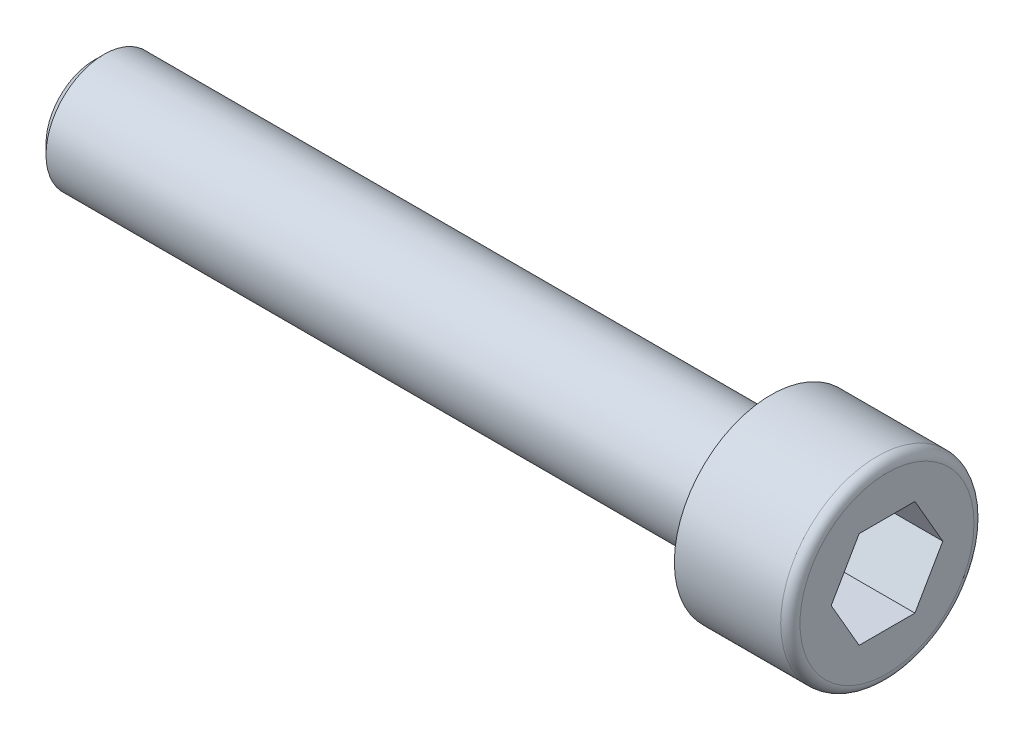
ISO-10303-21;
HEADER;
FILE_DESCRIPTION(('STEP AP214'),'2;1');
FILE_NAME('part.step','',(''),(''),'','','');
FILE_SCHEMA(('AUTOMOTIVE_DESIGN { 1 0 10303 214 1 1 1 1 }'));
ENDSEC;
DATA;
#1=APPLICATION_CONTEXT('core data for automotive mechanical design processes');
#2=APPLICATION_PROTOCOL_DEFINITION('international standard','automotive_design',2000,#1);
#3=PRODUCT_CONTEXT('',#1,'mechanical');
#4=PRODUCT('Part','Part','',(#3));
#5=PRODUCT_RELATED_PRODUCT_CATEGORY('part','',(#4));
#6=PRODUCT_DEFINITION_FORMATION('','',#4);
#7=PRODUCT_DEFINITION_CONTEXT('part definition',#1,'design');
#8=PRODUCT_DEFINITION('design','',#6,#7);
#9=PRODUCT_DEFINITION_SHAPE('','',#8);
#10=(LENGTH_UNIT() NAMED_UNIT(*) SI_UNIT(.MILLI.,.METRE.));
#11=(NAMED_UNIT(*) PLANE_ANGLE_UNIT() SI_UNIT($,.RADIAN.));
#12=(NAMED_UNIT(*) SI_UNIT($,.STERADIAN.) SOLID_ANGLE_UNIT());
#13=UNCERTAINTY_MEASURE_WITH_UNIT(LENGTH_MEASURE(1.E-05),#10,'distance_accuracy_value','');
#14=(GEOMETRIC_REPRESENTATION_CONTEXT(3) GLOBAL_UNCERTAINTY_ASSIGNED_CONTEXT((#13)) GLOBAL_UNIT_ASSIGNED_CONTEXT((#10,
#11,#12)) REPRESENTATION_CONTEXT('',''));
#15=CARTESIAN_POINT('',(0.,0.,0.));
#16=DIRECTION('',(0.,0.,1.));
#17=DIRECTION('',(1.,0.,0.));
#18=AXIS2_PLACEMENT_3D('',#15,#16,#17);
#19=CARTESIAN_POINT('',(0.,0.,0.));
#20=DIRECTION('',(-1.,0.,0.));
#21=DIRECTION('',(0.,0.,-1.));
#22=AXIS2_PLACEMENT_3D('',#19,#20,#21);
#23=PLANE('',#22);
#24=DIRECTION('',(0.,0.866025403784438,-0.5));
#25=VECTOR('',#24,1.);
#26=CARTESIAN_POINT('',(0.,0.,2.88675134594813));
#27=LINE('',#26,#25);
#28=CARTESIAN_POINT('',(0.,0.,2.88675134594813));
#29=VERTEX_POINT('',#28);
#30=CARTESIAN_POINT('',(0.,2.5,1.44337567297406));
#31=VERTEX_POINT('',#30);
#32=EDGE_CURVE('E106',#29,#31,#27,.T.);
#33=ORIENTED_EDGE('',*,*,#32,.T.);
#34=DIRECTION('',(0.,0.,-1.));
#35=VECTOR('',#34,1.);
#36=CARTESIAN_POINT('',(0.,2.5,1.44337567297406));
#37=LINE('',#36,#35);
#38=CARTESIAN_POINT('',(0.,2.5,-1.44337567297406));
#39=VERTEX_POINT('',#38);
#40=EDGE_CURVE('E110',#31,#39,#37,.T.);
#41=ORIENTED_EDGE('',*,*,#40,.T.);
#42=DIRECTION('',(0.,-0.866025403784439,-0.5));
#43=VECTOR('',#42,1.);
#44=CARTESIAN_POINT('',(0.,2.5,-1.44337567297406));
#45=LINE('',#44,#43);
#46=CARTESIAN_POINT('',(0.,0.,-2.88675134594813));
#47=VERTEX_POINT('',#46);
#48=EDGE_CURVE('E115',#39,#47,#45,.T.);
#49=ORIENTED_EDGE('',*,*,#48,.T.);
#50=DIRECTION('',(0.,-0.866025403784438,0.5));
#51=VECTOR('',#50,1.);
#52=CARTESIAN_POINT('',(0.,0.,-2.88675134594813));
#53=LINE('',#52,#51);
#54=CARTESIAN_POINT('',(0.,-2.5,-1.44337567297406));
#55=VERTEX_POINT('',#54);
#56=EDGE_CURVE('E125',#47,#55,#53,.T.);
#57=ORIENTED_EDGE('',*,*,#56,.T.);
#58=DIRECTION('',(0.,0.,1.));
#59=VECTOR('',#58,1.);
#60=CARTESIAN_POINT('',(0.,-2.5,-1.44337567297406));
#61=LINE('',#60,#59);
#62=CARTESIAN_POINT('',(0.,-2.5,1.44337567297406));
#63=VERTEX_POINT('',#62);
#64=EDGE_CURVE('E128',#55,#63,#61,.T.);
#65=ORIENTED_EDGE('',*,*,#64,.T.);
#66=DIRECTION('',(0.,0.866025403784439,0.5));
#67=VECTOR('',#66,1.);
#68=CARTESIAN_POINT('',(0.,-2.5,1.44337567297406));
#69=LINE('',#68,#67);
#70=EDGE_CURVE('E119',#63,#29,#69,.T.);
#71=ORIENTED_EDGE('',*,*,#70,.T.);
#72=EDGE_LOOP('',(#33,#41,#49,#57,#65,#71));
#73=FACE_BOUND('',#72,.T.);
#74=CARTESIAN_POINT('',(0.,0.,0.));
#75=DIRECTION('',(1.,0.,0.));
#76=DIRECTION('',(0.,0.,-1.));
#77=AXIS2_PLACEMENT_3D('',#74,#75,#76);
#78=CIRCLE('',#77,4.5);
#79=CARTESIAN_POINT('',(0.,0.,-4.5));
#80=VERTEX_POINT('',#79);
#81=EDGE_CURVE('E12',#80,#80,#78,.F.);
#82=ORIENTED_EDGE('',*,*,#81,.F.);
#83=EDGE_LOOP('',(#82));
#84=FACE_BOUND('',#83,.T.);
#85=ADVANCED_FACE('F39',(#73,#84),#23,.F.);
#86=CARTESIAN_POINT('',(-123.158940217391,0.,0.));
#87=DIRECTION('',(-1.,0.,0.));
#88=DIRECTION('',(0.,0.,-1.));
#89=AXIS2_PLACEMENT_3D('',#86,#87,#88);
#90=CYLINDRICAL_SURFACE('',#89,5.);
#91=CARTESIAN_POINT('',(-0.5,0.,0.));
#92=DIRECTION('',(1.,0.,0.));
#93=DIRECTION('',(0.,0.,-1.));
#94=AXIS2_PLACEMENT_3D('',#91,#92,#93);
#95=CIRCLE('',#94,5.);
#96=CARTESIAN_POINT('',(-0.5,0.,-5.));
#97=VERTEX_POINT('',#96);
#98=EDGE_CURVE('E47',#97,#97,#95,.T.);
#99=ORIENTED_EDGE('',*,*,#98,.F.);
#100=EDGE_LOOP('',(#99));
#101=FACE_BOUND('',#100,.T.);
#102=CARTESIAN_POINT('',(-6.00000000000001,0.,0.));
#103=DIRECTION('',(1.,0.,0.));
#104=DIRECTION('',(0.,0.,-1.));
#105=AXIS2_PLACEMENT_3D('',#102,#103,#104);
#106=CIRCLE('',#105,5.);
#107=CARTESIAN_POINT('',(-6.00000000000001,0.,-5.));
#108=VERTEX_POINT('',#107);
#109=EDGE_CURVE('E143',#108,#108,#106,.T.);
#110=ORIENTED_EDGE('',*,*,#109,.T.);
#111=EDGE_LOOP('',(#110));
#112=FACE_BOUND('',#111,.T.);
#113=ADVANCED_FACE('F155',(#101,#112),#90,.T.);
#114=CARTESIAN_POINT('',(-6.,5.,0.));
#115=DIRECTION('',(1.,0.,0.));
#116=DIRECTION('',(0.,0.,1.));
#117=AXIS2_PLACEMENT_3D('',#114,#115,#116);
#118=PLANE('',#117);
#119=CARTESIAN_POINT('',(-6.00000000000001,0.,0.));
#120=DIRECTION('',(1.,0.,0.));
#121=DIRECTION('',(0.,0.,-1.));
#122=AXIS2_PLACEMENT_3D('',#119,#120,#121);
#123=CIRCLE('',#122,3.);
#124=CARTESIAN_POINT('',(-6.00000000000001,0.,-3.));
#125=VERTEX_POINT('',#124);
#126=EDGE_CURVE('E139',#125,#125,#123,.T.);
#127=ORIENTED_EDGE('',*,*,#126,.T.);
#128=EDGE_LOOP('',(#127));
#129=FACE_BOUND('',#128,.T.);
#130=ORIENTED_EDGE('',*,*,#109,.F.);
#131=EDGE_LOOP('',(#130));
#132=FACE_BOUND('',#131,.T.);
#133=ADVANCED_FACE('F158',(#129,#132),#118,.F.);
#134=CARTESIAN_POINT('',(-123.158940217391,0.,0.));
#135=DIRECTION('',(-1.,0.,0.));
#136=DIRECTION('',(0.,0.,-1.));
#137=AXIS2_PLACEMENT_3D('',#134,#135,#136);
#138=CYLINDRICAL_SURFACE('',#137,3.);
#139=CARTESIAN_POINT('',(-40.5,0.,0.));
#140=DIRECTION('',(-1.,0.,0.));
#141=DIRECTION('',(0.,0.,1.));
#142=AXIS2_PLACEMENT_3D('',#139,#140,#141);
#143=CIRCLE('',#142,3.);
#144=CARTESIAN_POINT('',(-40.5,0.,3.));
#145=VERTEX_POINT('',#144);
#146=EDGE_CURVE('E149',#145,#145,#143,.T.);
#147=ORIENTED_EDGE('',*,*,#146,.F.);
#148=EDGE_LOOP('',(#147));
#149=FACE_BOUND('',#148,.T.);
#150=ORIENTED_EDGE('',*,*,#126,.F.);
#151=EDGE_LOOP('',(#150));
#152=FACE_BOUND('',#151,.T.);
#153=ADVANCED_FACE('F163',(#149,#152),#138,.T.);
#154=CARTESIAN_POINT('',(-41.,3.,0.));
#155=DIRECTION('',(1.,0.,0.));
#156=DIRECTION('',(0.,0.,1.));
#157=AXIS2_PLACEMENT_3D('',#154,#155,#156);
#158=PLANE('',#157);
#159=CARTESIAN_POINT('',(-41.,0.,0.));
#160=DIRECTION('',(-1.,0.,0.));
#161=DIRECTION('',(0.,0.,1.));
#162=AXIS2_PLACEMENT_3D('',#159,#160,#161);
#163=CIRCLE('',#162,2.50000000000001);
#164=CARTESIAN_POINT('',(-41.,0.,2.50000000000001));
#165=VERTEX_POINT('',#164);
#166=EDGE_CURVE('E146',#165,#165,#163,.F.);
#167=ORIENTED_EDGE('',*,*,#166,.F.);
#168=EDGE_LOOP('',(#167));
#169=FACE_BOUND('',#168,.T.);
#170=ADVANCED_FACE('F169',(#169),#158,.F.);
#171=CARTESIAN_POINT('',(-41.,0.,0.));
#172=DIRECTION('',(1.,0.,0.));
#173=DIRECTION('',(0.,0.,1.));
#174=AXIS2_PLACEMENT_3D('',#171,#172,#173);
#175=CONICAL_SURFACE('',#174,2.50000000000001,0.78539816339744);
#176=ORIENTED_EDGE('',*,*,#146,.T.);
#177=EDGE_LOOP('',(#176));
#178=FACE_BOUND('',#177,.T.);
#179=ORIENTED_EDGE('',*,*,#166,.T.);
#180=EDGE_LOOP('',(#179));
#181=FACE_BOUND('',#180,.T.);
#182=ADVANCED_FACE('F176',(#178,#181),#175,.T.);
#183=CARTESIAN_POINT('',(-0.5,0.,0.));
#184=DIRECTION('',(-1.,0.,0.));
#185=DIRECTION('',(0.,0.,-1.));
#186=AXIS2_PLACEMENT_3D('',#183,#184,#185);
#187=TOROIDAL_SURFACE('',#186,4.5,0.5);
#188=ORIENTED_EDGE('',*,*,#81,.T.);
#189=EDGE_LOOP('',(#188));
#190=FACE_BOUND('',#189,.T.);
#191=ORIENTED_EDGE('',*,*,#98,.T.);
#192=EDGE_LOOP('',(#191));
#193=FACE_BOUND('',#192,.T.);
#194=ADVANCED_FACE('F41',(#190,#193),#187,.T.);
#195=CARTESIAN_POINT('',(-13.6376261582597,-2.5,1.44337567297406));
#196=DIRECTION('',(0.,-0.5,0.866025403784438));
#197=DIRECTION('',(0.,0.866025403784439,0.5));
#198=AXIS2_PLACEMENT_3D('',#195,#196,#197);
#199=PLANE('',#198);
#200=DIRECTION('',(0.,-0.866025403784439,-0.5));
#201=VECTOR('',#200,1.);
#202=CARTESIAN_POINT('',(-5.,-2.5,1.44337567297406));
#203=LINE('',#202,#201);
#204=CARTESIAN_POINT('',(-5.,0.,2.88675134594813));
#205=VERTEX_POINT('',#204);
#206=CARTESIAN_POINT('',(-5.,-2.5,1.44337567297406));
#207=VERTEX_POINT('',#206);
#208=EDGE_CURVE('E140',#205,#207,#203,.T.);
#209=ORIENTED_EDGE('',*,*,#208,.F.);
#210=DIRECTION('',(1.,0.,0.));
#211=VECTOR('',#210,1.);
#212=CARTESIAN_POINT('',(-13.6376261582597,0.,2.88675134594813));
#213=LINE('',#212,#211);
#214=EDGE_CURVE('E54',#205,#29,#213,.T.);
#215=ORIENTED_EDGE('',*,*,#214,.T.);
#216=ORIENTED_EDGE('',*,*,#70,.F.);
#217=DIRECTION('',(1.,0.,0.));
#218=VECTOR('',#217,1.);
#219=CARTESIAN_POINT('',(-13.6376261582597,-2.5,1.44337567297406));
#220=LINE('',#219,#218);
#221=EDGE_CURVE('E130',#207,#63,#220,.T.);
#222=ORIENTED_EDGE('',*,*,#221,.F.);
#223=EDGE_LOOP('',(#209,#215,#216,#222));
#224=FACE_BOUND('',#223,.T.);
#225=ADVANCED_FACE('F183',(#224),#199,.F.);
#226=CARTESIAN_POINT('',(-13.6376261582597,-2.5,-1.44337567297406));
#227=DIRECTION('',(0.,-1.,0.));
#228=DIRECTION('',(0.,0.,1.));
#229=AXIS2_PLACEMENT_3D('',#226,#227,#228);
#230=PLANE('',#229);
#231=DIRECTION('',(0.,0.,-1.));
#232=VECTOR('',#231,1.);
#233=CARTESIAN_POINT('',(-5.,-2.5,-1.44337567297406));
#234=LINE('',#233,#232);
#235=CARTESIAN_POINT('',(-5.,-2.5,-1.44337567297406));
#236=VERTEX_POINT('',#235);
#237=EDGE_CURVE('E76',#207,#236,#234,.T.);
#238=ORIENTED_EDGE('',*,*,#237,.F.);
#239=ORIENTED_EDGE('',*,*,#221,.T.);
#240=ORIENTED_EDGE('',*,*,#64,.F.);
#241=DIRECTION('',(1.,0.,0.));
#242=VECTOR('',#241,1.);
#243=CARTESIAN_POINT('',(-13.6376261582597,-2.5,-1.44337567297406));
#244=LINE('',#243,#242);
#245=EDGE_CURVE('E132',#236,#55,#244,.T.);
#246=ORIENTED_EDGE('',*,*,#245,.F.);
#247=EDGE_LOOP('',(#238,#239,#240,#246));
#248=FACE_BOUND('',#247,.T.);
#249=ADVANCED_FACE('F197',(#248),#230,.F.);
#250=CARTESIAN_POINT('',(-13.6376261582597,0.,-2.88675134594813));
#251=DIRECTION('',(0.,-0.5,-0.866025403784438));
#252=DIRECTION('',(0.,-0.866025403784438,0.5));
#253=AXIS2_PLACEMENT_3D('',#250,#251,#252);
#254=PLANE('',#253);
#255=DIRECTION('',(0.,0.866025403784438,-0.5));
#256=VECTOR('',#255,1.);
#257=CARTESIAN_POINT('',(-5.,0.,-2.88675134594813));
#258=LINE('',#257,#256);
#259=CARTESIAN_POINT('',(-5.,0.,-2.88675134594813));
#260=VERTEX_POINT('',#259);
#261=EDGE_CURVE('E217',#236,#260,#258,.T.);
#262=ORIENTED_EDGE('',*,*,#261,.F.);
#263=ORIENTED_EDGE('',*,*,#245,.T.);
#264=ORIENTED_EDGE('',*,*,#56,.F.);
#265=DIRECTION('',(1.,0.,0.));
#266=VECTOR('',#265,1.);
#267=CARTESIAN_POINT('',(-13.6376261582597,0.,-2.88675134594813));
#268=LINE('',#267,#266);
#269=EDGE_CURVE('E134',#260,#47,#268,.T.);
#270=ORIENTED_EDGE('',*,*,#269,.F.);
#271=EDGE_LOOP('',(#262,#263,#264,#270));
#272=FACE_BOUND('',#271,.T.);
#273=ADVANCED_FACE('F206',(#272),#254,.F.);
#274=CARTESIAN_POINT('',(-13.6376261582597,2.5,-1.44337567297406));
#275=DIRECTION('',(0.,0.5,-0.866025403784438));
#276=DIRECTION('',(0.,-0.866025403784439,-0.5));
#277=AXIS2_PLACEMENT_3D('',#274,#275,#276);
#278=PLANE('',#277);
#279=DIRECTION('',(0.,0.866025403784439,0.5));
#280=VECTOR('',#279,1.);
#281=CARTESIAN_POINT('',(-5.,2.5,-1.44337567297406));
#282=LINE('',#281,#280);
#283=CARTESIAN_POINT('',(-5.,2.5,-1.44337567297406));
#284=VERTEX_POINT('',#283);
#285=EDGE_CURVE('E221',#260,#284,#282,.T.);
#286=ORIENTED_EDGE('',*,*,#285,.F.);
#287=ORIENTED_EDGE('',*,*,#269,.T.);
#288=ORIENTED_EDGE('',*,*,#48,.F.);
#289=DIRECTION('',(1.,0.,0.));
#290=VECTOR('',#289,1.);
#291=CARTESIAN_POINT('',(-13.6376261582597,2.5,-1.44337567297406));
#292=LINE('',#291,#290);
#293=EDGE_CURVE('E107',#284,#39,#292,.T.);
#294=ORIENTED_EDGE('',*,*,#293,.F.);
#295=EDGE_LOOP('',(#286,#287,#288,#294));
#296=FACE_BOUND('',#295,.T.);
#297=ADVANCED_FACE('F203',(#296),#278,.F.);
#298=CARTESIAN_POINT('',(-13.6376261582597,2.5,1.44337567297406));
#299=DIRECTION('',(0.,1.,0.));
#300=DIRECTION('',(0.,0.,-1.));
#301=AXIS2_PLACEMENT_3D('',#298,#299,#300);
#302=PLANE('',#301);
#303=DIRECTION('',(0.,0.,1.));
#304=VECTOR('',#303,1.);
#305=CARTESIAN_POINT('',(-5.,2.5,1.44337567297406));
#306=LINE('',#305,#304);
#307=CARTESIAN_POINT('',(-5.,2.5,1.44337567297406));
#308=VERTEX_POINT('',#307);
#309=EDGE_CURVE('E63',#284,#308,#306,.T.);
#310=ORIENTED_EDGE('',*,*,#309,.F.);
#311=ORIENTED_EDGE('',*,*,#293,.T.);
#312=ORIENTED_EDGE('',*,*,#40,.F.);
#313=DIRECTION('',(1.,0.,0.));
#314=VECTOR('',#313,1.);
#315=CARTESIAN_POINT('',(-13.6376261582597,2.5,1.44337567297406));
#316=LINE('',#315,#314);
#317=EDGE_CURVE('E102',#308,#31,#316,.T.);
#318=ORIENTED_EDGE('',*,*,#317,.F.);
#319=EDGE_LOOP('',(#310,#311,#312,#318));
#320=FACE_BOUND('',#319,.T.);
#321=ADVANCED_FACE('F111',(#320),#302,.F.);
#322=CARTESIAN_POINT('',(-13.6376261582597,0.,2.88675134594813));
#323=DIRECTION('',(0.,0.5,0.866025403784438));
#324=DIRECTION('',(0.,0.866025403784438,-0.5));
#325=AXIS2_PLACEMENT_3D('',#322,#323,#324);
#326=PLANE('',#325);
#327=DIRECTION('',(0.,-0.866025403784438,0.5));
#328=VECTOR('',#327,1.);
#329=CARTESIAN_POINT('',(-5.,0.,2.88675134594813));
#330=LINE('',#329,#328);
#331=EDGE_CURVE('E85',#308,#205,#330,.T.);
#332=ORIENTED_EDGE('',*,*,#331,.F.);
#333=ORIENTED_EDGE('',*,*,#317,.T.);
#334=ORIENTED_EDGE('',*,*,#32,.F.);
#335=ORIENTED_EDGE('',*,*,#214,.F.);
#336=EDGE_LOOP('',(#332,#333,#334,#335));
#337=FACE_BOUND('',#336,.T.);
#338=ADVANCED_FACE('F104',(#337),#326,.F.);
#339=CARTESIAN_POINT('',(-5.,5.,0.));
#340=DIRECTION('',(1.,0.,0.));
#341=DIRECTION('',(0.,0.,1.));
#342=AXIS2_PLACEMENT_3D('',#339,#340,#341);
#343=PLANE('',#342);
#344=ORIENTED_EDGE('',*,*,#208,.T.);
#345=ORIENTED_EDGE('',*,*,#237,.T.);
#346=ORIENTED_EDGE('',*,*,#261,.T.);
#347=ORIENTED_EDGE('',*,*,#285,.T.);
#348=ORIENTED_EDGE('',*,*,#309,.T.);
#349=ORIENTED_EDGE('',*,*,#331,.T.);
#350=EDGE_LOOP('',(#344,#345,#346,#347,#348,#349));
#351=FACE_BOUND('',#350,.T.);
#352=ADVANCED_FACE('F200',(#351),#343,.T.);
#353=CLOSED_SHELL('',(#85,#113,#133,#153,#170,#182,#194,#225,#249,#273,#297,#321,#338,#352));
#354=MANIFOLD_SOLID_BREP('B2',#353);
#355=ADVANCED_BREP_SHAPE_REPRESENTATION('',(#18,#354),#14);
#356=SHAPE_DEFINITION_REPRESENTATION(#9,#355);
ENDSEC;
END-ISO-10303-21;
